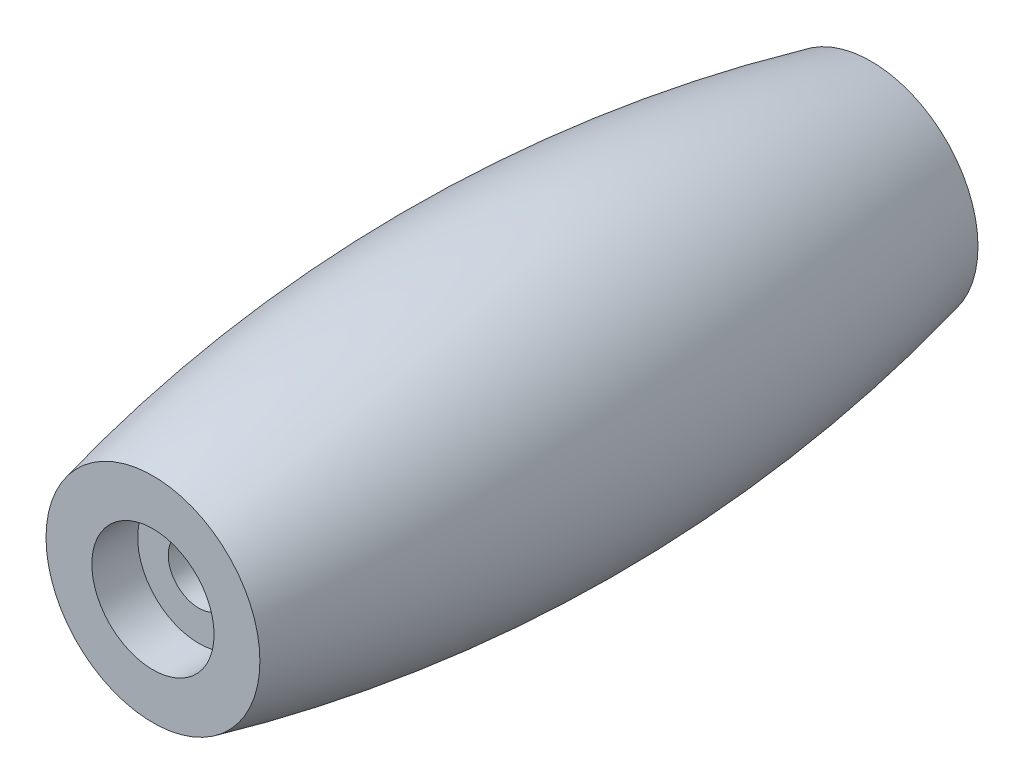
ISO-10303-21;
HEADER;
FILE_DESCRIPTION(('STEP AP214'),'2;1');
FILE_NAME('part.step','',(''),(''),'','','');
FILE_SCHEMA(('AUTOMOTIVE_DESIGN { 1 0 10303 214 1 1 1 1 }'));
ENDSEC;
DATA;
#1=APPLICATION_CONTEXT('core data for automotive mechanical design processes');
#2=APPLICATION_PROTOCOL_DEFINITION('international standard','automotive_design',2000,#1);
#3=PRODUCT_CONTEXT('',#1,'mechanical');
#4=PRODUCT('Part','Part','',(#3));
#5=PRODUCT_RELATED_PRODUCT_CATEGORY('part','',(#4));
#6=PRODUCT_DEFINITION_FORMATION('','',#4);
#7=PRODUCT_DEFINITION_CONTEXT('part definition',#1,'design');
#8=PRODUCT_DEFINITION('design','',#6,#7);
#9=PRODUCT_DEFINITION_SHAPE('','',#8);
#10=(LENGTH_UNIT() NAMED_UNIT(*) SI_UNIT(.MILLI.,.METRE.));
#11=(NAMED_UNIT(*) PLANE_ANGLE_UNIT() SI_UNIT($,.RADIAN.));
#12=(NAMED_UNIT(*) SI_UNIT($,.STERADIAN.) SOLID_ANGLE_UNIT());
#13=UNCERTAINTY_MEASURE_WITH_UNIT(LENGTH_MEASURE(1.E-05),#10,'distance_accuracy_value','');
#14=(GEOMETRIC_REPRESENTATION_CONTEXT(3) GLOBAL_UNCERTAINTY_ASSIGNED_CONTEXT((#13)) GLOBAL_UNIT_ASSIGNED_CONTEXT((#10,
#11,#12)) REPRESENTATION_CONTEXT('',''));
#15=CARTESIAN_POINT('',(0.,0.,0.));
#16=DIRECTION('',(0.,0.,1.));
#17=DIRECTION('',(1.,0.,0.));
#18=AXIS2_PLACEMENT_3D('',#15,#16,#17);
#19=CARTESIAN_POINT('',(0.,0.,-47.));
#20=DIRECTION('',(0.,0.,1.));
#21=DIRECTION('',(1.,0.,0.));
#22=AXIS2_PLACEMENT_3D('',#19,#20,#21);
#23=CYLINDRICAL_SURFACE('',#22,2.);
#24=CARTESIAN_POINT('',(0.,0.,-3.));
#25=DIRECTION('',(0.,0.,1.));
#26=DIRECTION('',(1.,0.,0.));
#27=AXIS2_PLACEMENT_3D('',#24,#25,#26);
#28=CIRCLE('',#27,2.);
#29=CARTESIAN_POINT('',(2.,0.,-3.));
#30=VERTEX_POINT('',#29);
#31=EDGE_CURVE('E46',#30,#30,#28,.F.);
#32=ORIENTED_EDGE('',*,*,#31,.F.);
#33=EDGE_LOOP('',(#32));
#34=FACE_BOUND('',#33,.T.);
#35=CARTESIAN_POINT('',(0.,0.,-44.));
#36=DIRECTION('',(0.,0.,-1.));
#37=DIRECTION('',(-1.,0.,0.));
#38=AXIS2_PLACEMENT_3D('',#35,#36,#37);
#39=CIRCLE('',#38,2.);
#40=CARTESIAN_POINT('',(-2.,0.,-44.));
#41=VERTEX_POINT('',#40);
#42=EDGE_CURVE('E37',#41,#41,#39,.F.);
#43=ORIENTED_EDGE('',*,*,#42,.F.);
#44=EDGE_LOOP('',(#43));
#45=FACE_BOUND('',#44,.T.);
#46=ADVANCED_FACE('F33',(#34,#45),#23,.F.);
#47=CARTESIAN_POINT('',(-7.,0.,0.));
#48=DIRECTION('',(0.,0.,-1.));
#49=DIRECTION('',(-1.,0.,0.));
#50=AXIS2_PLACEMENT_3D('',#47,#48,#49);
#51=PLANE('',#50);
#52=CARTESIAN_POINT('',(0.,0.,0.));
#53=DIRECTION('',(0.,0.,1.));
#54=DIRECTION('',(1.,0.,0.));
#55=AXIS2_PLACEMENT_3D('',#52,#53,#54);
#56=CIRCLE('',#55,4.);
#57=CARTESIAN_POINT('',(4.,0.,0.));
#58=VERTEX_POINT('',#57);
#59=EDGE_CURVE('E54',#58,#58,#56,.T.);
#60=ORIENTED_EDGE('',*,*,#59,.F.);
#61=EDGE_LOOP('',(#60));
#62=FACE_BOUND('',#61,.T.);
#63=CARTESIAN_POINT('',(0.,0.,0.));
#64=DIRECTION('',(0.,0.,1.));
#65=DIRECTION('',(1.,0.,0.));
#66=AXIS2_PLACEMENT_3D('',#63,#64,#65);
#67=CIRCLE('',#66,7.00000000000003);
#68=CARTESIAN_POINT('',(7.00000000000003,0.,0.));
#69=VERTEX_POINT('',#68);
#70=EDGE_CURVE('E41',#69,#69,#67,.T.);
#71=ORIENTED_EDGE('',*,*,#70,.T.);
#72=EDGE_LOOP('',(#71));
#73=FACE_BOUND('',#72,.T.);
#74=ADVANCED_FACE('F35',(#62,#73),#51,.F.);
#75=CARTESIAN_POINT('',(0.,0.,-47.));
#76=DIRECTION('',(0.,0.,1.));
#77=DIRECTION('',(1.,0.,0.));
#78=AXIS2_PLACEMENT_3D('',#75,#76,#77);
#79=PLANE('',#78);
#80=CARTESIAN_POINT('',(0.,0.,-47.));
#81=DIRECTION('',(0.,0.,1.));
#82=DIRECTION('',(1.,0.,0.));
#83=AXIS2_PLACEMENT_3D('',#80,#81,#82);
#84=CIRCLE('',#83,4.);
#85=CARTESIAN_POINT('',(4.,0.,-47.));
#86=VERTEX_POINT('',#85);
#87=EDGE_CURVE('E60',#86,#86,#84,.T.);
#88=ORIENTED_EDGE('',*,*,#87,.T.);
#89=EDGE_LOOP('',(#88));
#90=FACE_BOUND('',#89,.T.);
#91=CARTESIAN_POINT('',(0.,0.,-47.));
#92=DIRECTION('',(0.,0.,1.));
#93=DIRECTION('',(1.,0.,0.));
#94=AXIS2_PLACEMENT_3D('',#91,#92,#93);
#95=CIRCLE('',#94,6.99999999999993);
#96=CARTESIAN_POINT('',(6.99999999999993,0.,-47.));
#97=VERTEX_POINT('',#96);
#98=EDGE_CURVE('E10',#97,#97,#95,.T.);
#99=ORIENTED_EDGE('',*,*,#98,.F.);
#100=EDGE_LOOP('',(#99));
#101=FACE_BOUND('',#100,.T.);
#102=ADVANCED_FACE('F78',(#90,#101),#79,.F.);
#103=CARTESIAN_POINT('',(0.,0.,-23.4999999999998));
#104=DIRECTION('',(0.,0.,1.));
#105=DIRECTION('',(1.,0.,0.));
#106=AXIS2_PLACEMENT_3D('',#103,#104,#105);
#107=DEGENERATE_TOROIDAL_SURFACE('',#106,92.9677752293579,102.692775229358,.F.);
#108=ORIENTED_EDGE('',*,*,#70,.F.);
#109=EDGE_LOOP('',(#108));
#110=FACE_BOUND('',#109,.T.);
#111=ORIENTED_EDGE('',*,*,#98,.T.);
#112=EDGE_LOOP('',(#111));
#113=FACE_BOUND('',#112,.T.);
#114=ADVANCED_FACE('F84',(#110,#113),#107,.F.);
#115=CARTESIAN_POINT('',(0.,0.,-3.));
#116=DIRECTION('',(0.,0.,1.));
#117=DIRECTION('',(1.,0.,0.));
#118=AXIS2_PLACEMENT_3D('',#115,#116,#117);
#119=PLANE('',#118);
#120=CARTESIAN_POINT('',(0.,0.,-3.));
#121=DIRECTION('',(0.,0.,1.));
#122=DIRECTION('',(1.,0.,0.));
#123=AXIS2_PLACEMENT_3D('',#120,#121,#122);
#124=CIRCLE('',#123,4.);
#125=CARTESIAN_POINT('',(4.,0.,-3.));
#126=VERTEX_POINT('',#125);
#127=EDGE_CURVE('E50',#126,#126,#124,.T.);
#128=ORIENTED_EDGE('',*,*,#127,.T.);
#129=EDGE_LOOP('',(#128));
#130=FACE_BOUND('',#129,.T.);
#131=ORIENTED_EDGE('',*,*,#31,.T.);
#132=EDGE_LOOP('',(#131));
#133=FACE_BOUND('',#132,.T.);
#134=ADVANCED_FACE('F86',(#130,#133),#119,.T.);
#135=CARTESIAN_POINT('',(0.,0.,-3.));
#136=DIRECTION('',(0.,0.,1.));
#137=DIRECTION('',(1.,0.,0.));
#138=AXIS2_PLACEMENT_3D('',#135,#136,#137);
#139=CYLINDRICAL_SURFACE('',#138,4.);
#140=ORIENTED_EDGE('',*,*,#127,.F.);
#141=EDGE_LOOP('',(#140));
#142=FACE_BOUND('',#141,.T.);
#143=ORIENTED_EDGE('',*,*,#59,.T.);
#144=EDGE_LOOP('',(#143));
#145=FACE_BOUND('',#144,.T.);
#146=ADVANCED_FACE('F82',(#142,#145),#139,.F.);
#147=CARTESIAN_POINT('',(0.,0.,-44.));
#148=DIRECTION('',(0.,0.,-1.));
#149=DIRECTION('',(1.,0.,0.));
#150=AXIS2_PLACEMENT_3D('',#147,#148,#149);
#151=PLANE('',#150);
#152=CARTESIAN_POINT('',(0.,0.,-44.));
#153=DIRECTION('',(0.,0.,1.));
#154=DIRECTION('',(1.,0.,0.));
#155=AXIS2_PLACEMENT_3D('',#152,#153,#154);
#156=CIRCLE('',#155,4.);
#157=CARTESIAN_POINT('',(4.,0.,-44.));
#158=VERTEX_POINT('',#157);
#159=EDGE_CURVE('E63',#158,#158,#156,.T.);
#160=ORIENTED_EDGE('',*,*,#159,.F.);
#161=EDGE_LOOP('',(#160));
#162=FACE_BOUND('',#161,.T.);
#163=ORIENTED_EDGE('',*,*,#42,.T.);
#164=EDGE_LOOP('',(#163));
#165=FACE_BOUND('',#164,.T.);
#166=ADVANCED_FACE('F70',(#162,#165),#151,.T.);
#167=CARTESIAN_POINT('',(0.,0.,-44.));
#168=DIRECTION('',(0.,0.,-1.));
#169=DIRECTION('',(-1.,0.,0.));
#170=AXIS2_PLACEMENT_3D('',#167,#168,#169);
#171=CYLINDRICAL_SURFACE('',#170,4.);
#172=ORIENTED_EDGE('',*,*,#159,.T.);
#173=EDGE_LOOP('',(#172));
#174=FACE_BOUND('',#173,.T.);
#175=ORIENTED_EDGE('',*,*,#87,.F.);
#176=EDGE_LOOP('',(#175));
#177=FACE_BOUND('',#176,.T.);
#178=ADVANCED_FACE('F95',(#174,#177),#171,.F.);
#179=CLOSED_SHELL('',(#46,#74,#102,#114,#134,#146,#166,#178));
#180=MANIFOLD_SOLID_BREP('B2',#179);
#181=ADVANCED_BREP_SHAPE_REPRESENTATION('',(#18,#180),#14);
#182=SHAPE_DEFINITION_REPRESENTATION(#9,#181);
ENDSEC;
END-ISO-10303-21;
